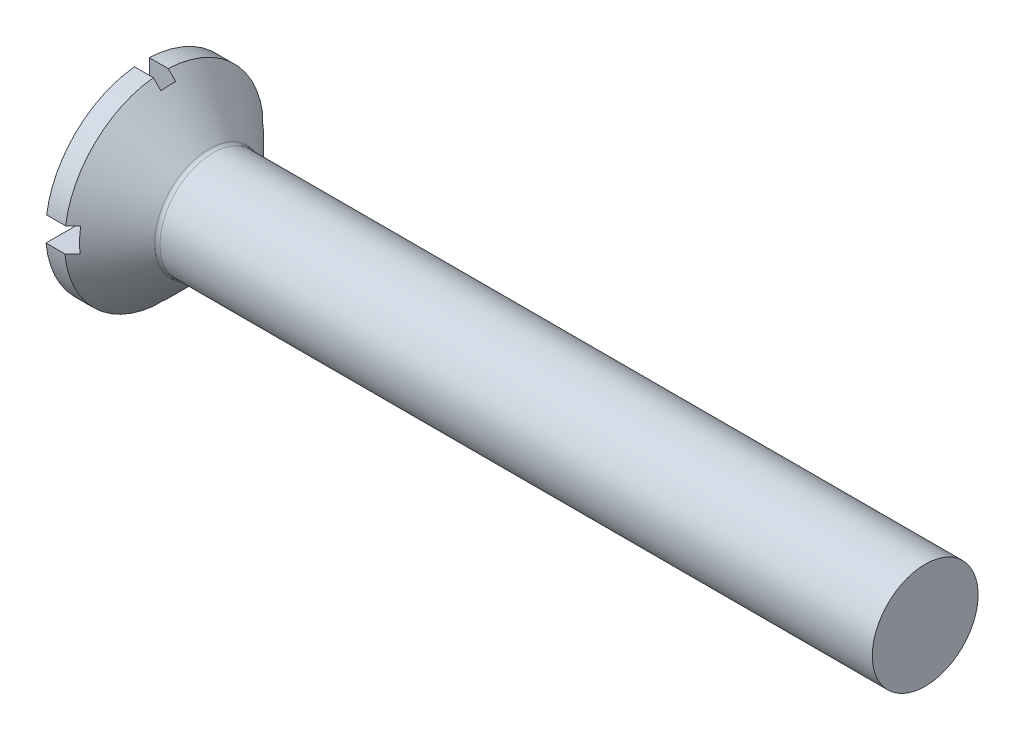
ISO-10303-21;
HEADER;
FILE_DESCRIPTION(('STEP AP214'),'2;1');
FILE_NAME('part.step','',(''),(''),'','','');
FILE_SCHEMA(('AUTOMOTIVE_DESIGN { 1 0 10303 214 1 1 1 1 }'));
ENDSEC;
DATA;
#1=APPLICATION_CONTEXT('core data for automotive mechanical design processes');
#2=APPLICATION_PROTOCOL_DEFINITION('international standard','automotive_design',2000,#1);
#3=PRODUCT_CONTEXT('',#1,'mechanical');
#4=PRODUCT('Part','Part','',(#3));
#5=PRODUCT_RELATED_PRODUCT_CATEGORY('part','',(#4));
#6=PRODUCT_DEFINITION_FORMATION('','',#4);
#7=PRODUCT_DEFINITION_CONTEXT('part definition',#1,'design');
#8=PRODUCT_DEFINITION('design','',#6,#7);
#9=PRODUCT_DEFINITION_SHAPE('','',#8);
#10=(LENGTH_UNIT() NAMED_UNIT(*) SI_UNIT(.MILLI.,.METRE.));
#11=(NAMED_UNIT(*) PLANE_ANGLE_UNIT() SI_UNIT($,.RADIAN.));
#12=(NAMED_UNIT(*) SI_UNIT($,.STERADIAN.) SOLID_ANGLE_UNIT());
#13=UNCERTAINTY_MEASURE_WITH_UNIT(LENGTH_MEASURE(1.E-05),#10,'distance_accuracy_value','');
#14=(GEOMETRIC_REPRESENTATION_CONTEXT(3) GLOBAL_UNCERTAINTY_ASSIGNED_CONTEXT((#13)) GLOBAL_UNIT_ASSIGNED_CONTEXT((#10,
#11,#12)) REPRESENTATION_CONTEXT('',''));
#15=CARTESIAN_POINT('',(0.,0.,0.));
#16=DIRECTION('',(0.,0.,1.));
#17=DIRECTION('',(1.,0.,0.));
#18=AXIS2_PLACEMENT_3D('',#15,#16,#17);
#19=CARTESIAN_POINT('',(1.,0.,0.));
#20=DIRECTION('',(-1.,0.,0.));
#21=DIRECTION('',(0.,0.,1.));
#22=AXIS2_PLACEMENT_3D('',#19,#20,#21);
#23=PLANE('',#22);
#24=DIRECTION('',(0.,1.,0.));
#25=VECTOR('',#24,1.);
#26=CARTESIAN_POINT('',(1.,-0.355709243839864,-0.156923110621762));
#27=LINE('',#26,#25);
#28=CARTESIAN_POINT('',(1.,-0.355709243839864,-0.156923110621762));
#29=VERTEX_POINT('',#28);
#30=CARTESIAN_POINT('',(1.0000000000166,-3.47646014463617,-0.156923110621762));
#31=VERTEX_POINT('',#30);
#32=EDGE_CURVE('E330',#29,#31,#27,.F.);
#33=ORIENTED_EDGE('',*,*,#32,.T.);
#34=CARTESIAN_POINT('',(1.0000000000332,0.,0.));
#35=DIRECTION('',(-1.,0.,0.));
#36=DIRECTION('',(0.,0.,1.));
#37=AXIS2_PLACEMENT_3D('',#34,#35,#36);
#38=CIRCLE('',#37,3.47999999996773);
#39=CARTESIAN_POINT('',(1.00000000002008,-3.456568160324,0.403158223159427));
#40=VERTEX_POINT('',#39);
#41=EDGE_CURVE('E230',#31,#40,#38,.T.);
#42=ORIENTED_EDGE('',*,*,#41,.T.);
#43=DIRECTION('',(0.,-1.,0.));
#44=VECTOR('',#43,1.);
#45=CARTESIAN_POINT('',(1.,-4.05674824255773,0.403158223159427));
#46=LINE('',#45,#44);
#47=CARTESIAN_POINT('',(1.,-0.355709243839864,0.403158223159425));
#48=VERTEX_POINT('',#47);
#49=EDGE_CURVE('E139',#40,#48,#46,.F.);
#50=ORIENTED_EDGE('',*,*,#49,.T.);
#51=DIRECTION('',(0.,0.,-1.));
#52=VECTOR('',#51,1.);
#53=CARTESIAN_POINT('',(1.,-0.355709243839864,0.403158223159425));
#54=LINE('',#53,#52);
#55=CARTESIAN_POINT('',(1.0000000000166,-0.355709243839867,3.46177280215467));
#56=VERTEX_POINT('',#55);
#57=EDGE_CURVE('E155',#48,#56,#54,.F.);
#58=ORIENTED_EDGE('',*,*,#57,.T.);
#59=CARTESIAN_POINT('',(1.0000000000332,0.,0.));
#60=DIRECTION('',(-1.,0.,0.));
#61=DIRECTION('',(0.,0.,1.));
#62=AXIS2_PLACEMENT_3D('',#59,#60,#61);
#63=CIRCLE('',#62,3.47999999996773);
#64=CARTESIAN_POINT('',(1.00000000002006,0.550618510763713,3.43616345005169));
#65=VERTEX_POINT('',#64);
#66=EDGE_CURVE('E20',#56,#65,#63,.T.);
#67=ORIENTED_EDGE('',*,*,#66,.T.);
#68=DIRECTION('',(0.,0.,1.));
#69=VECTOR('',#68,1.);
#70=CARTESIAN_POINT('',(1.,0.550618510763713,4.40763775047384));
#71=LINE('',#70,#69);
#72=CARTESIAN_POINT('',(1.,0.550618510763712,0.403158223159425));
#73=VERTEX_POINT('',#72);
#74=EDGE_CURVE('E119',#65,#73,#71,.F.);
#75=ORIENTED_EDGE('',*,*,#74,.T.);
#76=DIRECTION('',(0.,-1.,0.));
#77=VECTOR('',#76,1.);
#78=CARTESIAN_POINT('',(1.,0.550618510763713,0.403158223159425));
#79=LINE('',#78,#77);
#80=CARTESIAN_POINT('',(1.0000000000166,3.4565681603275,0.403158223159424));
#81=VERTEX_POINT('',#80);
#82=EDGE_CURVE('E339',#73,#81,#79,.F.);
#83=ORIENTED_EDGE('',*,*,#82,.T.);
#84=CARTESIAN_POINT('',(1.0000000000332,0.,0.));
#85=DIRECTION('',(-1.,0.,0.));
#86=DIRECTION('',(0.,0.,1.));
#87=AXIS2_PLACEMENT_3D('',#84,#85,#86);
#88=CIRCLE('',#87,3.47999999996773);
#89=CARTESIAN_POINT('',(1.0000000000201,3.47646014463266,-0.156923110621762));
#90=VERTEX_POINT('',#89);
#91=EDGE_CURVE('E154',#81,#90,#88,.T.);
#92=ORIENTED_EDGE('',*,*,#91,.T.);
#93=DIRECTION('',(0.,1.,0.));
#94=VECTOR('',#93,1.);
#95=CARTESIAN_POINT('',(1.,4.34325175744227,-0.156923110621762));
#96=LINE('',#95,#94);
#97=CARTESIAN_POINT('',(1.,0.550618510763712,-0.156923110621762));
#98=VERTEX_POINT('',#97);
#99=EDGE_CURVE('E341',#90,#98,#96,.F.);
#100=ORIENTED_EDGE('',*,*,#99,.T.);
#101=DIRECTION('',(0.,0.,1.));
#102=VECTOR('',#101,1.);
#103=CARTESIAN_POINT('',(1.,0.550618510763713,-0.156923110621761));
#104=LINE('',#103,#102);
#105=CARTESIAN_POINT('',(1.0000000000166,0.550618510763713,-3.4361634500552));
#106=VERTEX_POINT('',#105);
#107=EDGE_CURVE('E229',#98,#106,#104,.F.);
#108=ORIENTED_EDGE('',*,*,#107,.T.);
#109=CARTESIAN_POINT('',(1.0000000000332,0.,0.));
#110=DIRECTION('',(-1.,0.,0.));
#111=DIRECTION('',(0.,0.,1.));
#112=AXIS2_PLACEMENT_3D('',#109,#110,#111);
#113=CIRCLE('',#112,3.47999999996773);
#114=CARTESIAN_POINT('',(1.00000000002009,-0.355709243839861,-3.46177280215116));
#115=VERTEX_POINT('',#114);
#116=EDGE_CURVE('E402',#106,#115,#113,.T.);
#117=ORIENTED_EDGE('',*,*,#116,.T.);
#118=DIRECTION('',(0.,0.,-1.));
#119=VECTOR('',#118,1.);
#120=CARTESIAN_POINT('',(1.,-0.355709243839861,-4.09236224952616));
#121=LINE('',#120,#119);
#122=EDGE_CURVE('E148',#115,#29,#121,.F.);
#123=ORIENTED_EDGE('',*,*,#122,.T.);
#124=EDGE_LOOP('',(#33,#42,#50,#58,#67,#75,#83,#92,#100,#108,#117,#123));
#125=FACE_BOUND('',#124,.T.);
#126=ADVANCED_FACE('F17',(#125),#23,.T.);
#127=CARTESIAN_POINT('',(1.,0.550618510763713,-0.156923110621761));
#128=DIRECTION('',(0.,1.,0.));
#129=DIRECTION('',(0.,0.,1.));
#130=AXIS2_PLACEMENT_3D('',#127,#128,#129);
#131=PLANE('',#130);
#132=CARTESIAN_POINT('',(1.00000000000693,0.550618510763713,-3.43616345006499));
#133=CARTESIAN_POINT('',(0.952522390497496,0.550618510763713,-3.48424489385891));
#134=CARTESIAN_POINT('',(0.905033585692067,0.550618510763713,-3.53231527264755));
#135=CARTESIAN_POINT('',(0.810033585692013,0.550618510763713,-3.62843390000909));
#136=CARTESIAN_POINT('',(0.762522390497485,0.550618510763712,-3.67648214858208));
#137=CARTESIAN_POINT('',(0.715000000007059,0.550618510763712,-3.72451933214988));
#138=B_SPLINE_CURVE_WITH_KNOTS('',3,(#132,#133,#134,#135,#136,#137),.UNSPECIFIED.,.F.,.F.,(4,2,
4),(0.,0.202715394305867,0.405430787746274),.UNSPECIFIED.);
#139=CARTESIAN_POINT('',(0.715000000010424,0.550618510763712,-3.72451933215298));
#140=VERTEX_POINT('',#139);
#141=EDGE_CURVE('E223',#106,#140,#138,.T.);
#142=ORIENTED_EDGE('',*,*,#141,.F.);
#143=ORIENTED_EDGE('',*,*,#107,.F.);
#144=DIRECTION('',(-1.,0.,0.));
#145=VECTOR('',#144,1.);
#146=CARTESIAN_POINT('',(1.,0.550618510763712,-0.156923110621762));
#147=LINE('',#146,#145);
#148=CARTESIAN_POINT('',(0.,0.550618510763712,-0.156923110621762));
#149=VERTEX_POINT('',#148);
#150=EDGE_CURVE('E130',#98,#149,#147,.T.);
#151=ORIENTED_EDGE('',*,*,#150,.T.);
#152=DIRECTION('',(0.,0.,-1.));
#153=VECTOR('',#152,1.);
#154=CARTESIAN_POINT('',(0.,0.550618510763712,0.));
#155=LINE('',#154,#153);
#156=CARTESIAN_POINT('',(0.,0.550618510763712,-3.72451933215608));
#157=VERTEX_POINT('',#156);
#158=EDGE_CURVE('E309',#149,#157,#155,.T.);
#159=ORIENTED_EDGE('',*,*,#158,.T.);
#160=DIRECTION('',(1.,0.,0.));
#161=VECTOR('',#160,1.);
#162=CARTESIAN_POINT('',(1.,0.550618510763712,-3.72451933215607));
#163=LINE('',#162,#161);
#164=EDGE_CURVE('E228',#140,#157,#163,.F.);
#165=ORIENTED_EDGE('',*,*,#164,.F.);
#166=EDGE_LOOP('',(#142,#143,#151,#159,#165));
#167=FACE_BOUND('',#166,.T.);
#168=ADVANCED_FACE('F232',(#167),#131,.F.);
#169=CARTESIAN_POINT('',(1.,4.34325175744227,-0.156923110621762));
#170=DIRECTION('',(0.,0.,-1.));
#171=DIRECTION('',(-1.,0.,0.));
#172=AXIS2_PLACEMENT_3D('',#169,#170,#171);
#173=PLANE('',#172);
#174=DIRECTION('',(0.,1.,0.));
#175=VECTOR('',#174,1.);
#176=CARTESIAN_POINT('',(0.,0.,-0.156923110621762));
#177=LINE('',#176,#175);
#178=CARTESIAN_POINT('',(0.,3.7617283444386,-0.156923110621762));
#179=VERTEX_POINT('',#178);
#180=EDGE_CURVE('E305',#179,#149,#177,.F.);
#181=ORIENTED_EDGE('',*,*,#180,.T.);
#182=ORIENTED_EDGE('',*,*,#150,.F.);
#183=ORIENTED_EDGE('',*,*,#99,.F.);
#184=CARTESIAN_POINT('',(0.715000000003793,3.76172834443573,-0.156923110621762));
#185=CARTESIAN_POINT('',(0.762501760869479,3.71418540368166,-0.156923110621762));
#186=CARTESIAN_POINT('',(0.81000264130227,3.66664158332245,-0.156923110621762));
#187=CARTESIAN_POINT('',(0.905002641303341,3.57155218339247,-0.156923110621762));
#188=CARTESIAN_POINT('',(0.952501760871621,3.52400660382169,-0.156923110621762));
#189=CARTESIAN_POINT('',(1.00000000000701,3.47646014464577,-0.156923110621762));
#190=B_SPLINE_CURVE_WITH_KNOTS('',3,(#184,#185,#186,#187,#188,#189),.UNSPECIFIED.,.F.,.F.,(4,2,
4),(0.,0.201620277914085,0.403240555833609),.UNSPECIFIED.);
#191=CARTESIAN_POINT('',(0.715000000007359,3.76172834443217,-0.156923110621762));
#192=VERTEX_POINT('',#191);
#193=EDGE_CURVE('E216',#192,#90,#190,.T.);
#194=ORIENTED_EDGE('',*,*,#193,.F.);
#195=DIRECTION('',(-1.,0.,0.));
#196=VECTOR('',#195,1.);
#197=CARTESIAN_POINT('',(1.,3.7617283444386,-0.156923110621762));
#198=LINE('',#197,#196);
#199=EDGE_CURVE('E337',#179,#192,#198,.F.);
#200=ORIENTED_EDGE('',*,*,#199,.F.);
#201=EDGE_LOOP('',(#181,#182,#183,#194,#200));
#202=FACE_BOUND('',#201,.T.);
#203=ADVANCED_FACE('F235',(#202),#173,.F.);
#204=CARTESIAN_POINT('',(1.,0.550618510763713,0.403158223159425));
#205=DIRECTION('',(0.,0.,1.));
#206=DIRECTION('',(0.,-1.,0.));
#207=AXIS2_PLACEMENT_3D('',#204,#205,#206);
#208=PLANE('',#207);
#209=CARTESIAN_POINT('',(1.00000000000697,3.4565681603372,0.403158223159424));
#210=CARTESIAN_POINT('',(0.952511808864706,3.50437729702399,0.403158223159424));
#211=CARTESIAN_POINT('',(0.905017713279324,3.55218056600584,0.403158223159424));
#212=CARTESIAN_POINT('',(0.810017713279351,3.64777536850222,0.403158223159424));
#213=CARTESIAN_POINT('',(0.762511808864773,3.69556690201678,0.403158223159424));
#214=CARTESIAN_POINT('',(0.715000000007091,3.7433525678264,0.403158223159424));
#215=B_SPLINE_CURVE_WITH_KNOTS('',3,(#209,#210,#211,#212,#213,#214),.UNSPECIFIED.,.F.,.F.,(4,2,
4),(0.,0.202157302038321,0.404314603833935),.UNSPECIFIED.);
#216=CARTESIAN_POINT('',(0.715000000010439,3.7433525678295,0.403158223159424));
#217=VERTEX_POINT('',#216);
#218=EDGE_CURVE('E209',#81,#217,#215,.T.);
#219=ORIENTED_EDGE('',*,*,#218,.F.);
#220=ORIENTED_EDGE('',*,*,#82,.F.);
#221=DIRECTION('',(1.,0.,0.));
#222=VECTOR('',#221,1.);
#223=CARTESIAN_POINT('',(1.,0.550618510763712,0.403158223159425));
#224=LINE('',#223,#222);
#225=CARTESIAN_POINT('',(0.,0.550618510763713,0.403158223159425));
#226=VERTEX_POINT('',#225);
#227=EDGE_CURVE('E331',#73,#226,#224,.F.);
#228=ORIENTED_EDGE('',*,*,#227,.T.);
#229=DIRECTION('',(0.,1.,0.));
#230=VECTOR('',#229,1.);
#231=CARTESIAN_POINT('',(0.,0.,0.403158223159425));
#232=LINE('',#231,#230);
#233=CARTESIAN_POINT('',(0.,3.7433525678326,0.403158223159424));
#234=VERTEX_POINT('',#233);
#235=EDGE_CURVE('E300',#226,#234,#232,.T.);
#236=ORIENTED_EDGE('',*,*,#235,.T.);
#237=DIRECTION('',(1.,0.,0.));
#238=VECTOR('',#237,1.);
#239=CARTESIAN_POINT('',(1.,3.7433525678326,0.403158223159424));
#240=LINE('',#239,#238);
#241=EDGE_CURVE('E335',#217,#234,#240,.F.);
#242=ORIENTED_EDGE('',*,*,#241,.F.);
#243=EDGE_LOOP('',(#219,#220,#228,#236,#242));
#244=FACE_BOUND('',#243,.T.);
#245=ADVANCED_FACE('F238',(#244),#208,.F.);
#246=CARTESIAN_POINT('',(1.,0.550618510763713,4.40763775047384));
#247=DIRECTION('',(0.,1.,0.));
#248=DIRECTION('',(0.,0.,1.));
#249=AXIS2_PLACEMENT_3D('',#246,#247,#248);
#250=PLANE('',#249);
#251=DIRECTION('',(0.,0.,-1.));
#252=VECTOR('',#251,1.);
#253=CARTESIAN_POINT('',(0.,0.550618510763713,0.));
#254=LINE('',#253,#252);
#255=CARTESIAN_POINT('',(0.,0.550618510763713,3.72451933215608));
#256=VERTEX_POINT('',#255);
#257=EDGE_CURVE('E295',#256,#226,#254,.T.);
#258=ORIENTED_EDGE('',*,*,#257,.T.);
#259=ORIENTED_EDGE('',*,*,#227,.F.);
#260=ORIENTED_EDGE('',*,*,#74,.F.);
#261=CARTESIAN_POINT('',(0.715000000003765,0.550618510763713,3.72451933215321));
#262=CARTESIAN_POINT('',(0.76252239049474,0.550618510763713,3.67648214858485));
#263=CARTESIAN_POINT('',(0.810033585689818,0.550618510763713,3.62843390001131));
#264=CARTESIAN_POINT('',(0.90503358569097,0.550618510763713,3.53231527264866));
#265=CARTESIAN_POINT('',(0.952522390496948,0.550618510763713,3.48424489385947));
#266=CARTESIAN_POINT('',(1.00000000000693,0.550618510763713,3.43616345006499));
#267=B_SPLINE_CURVE_WITH_KNOTS('',3,(#261,#262,#263,#264,#265,#266),.UNSPECIFIED.,.F.,.F.,(4,2,
4),(0.,0.202715393442749,0.405430787750959),.UNSPECIFIED.);
#268=CARTESIAN_POINT('',(0.715000000007359,0.550618510763713,3.72451933214958));
#269=VERTEX_POINT('',#268);
#270=EDGE_CURVE('E112',#269,#65,#267,.T.);
#271=ORIENTED_EDGE('',*,*,#270,.F.);
#272=DIRECTION('',(1.,0.,0.));
#273=VECTOR('',#272,1.);
#274=CARTESIAN_POINT('',(1.,0.550618510763713,3.72451933215607));
#275=LINE('',#274,#273);
#276=EDGE_CURVE('E328',#256,#269,#275,.T.);
#277=ORIENTED_EDGE('',*,*,#276,.F.);
#278=EDGE_LOOP('',(#258,#259,#260,#271,#277));
#279=FACE_BOUND('',#278,.T.);
#280=ADVANCED_FACE('F242',(#279),#250,.F.);
#281=CARTESIAN_POINT('',(1.,-0.355709243839864,-0.156923110621762));
#282=DIRECTION('',(0.,0.,-1.));
#283=DIRECTION('',(-1.,0.,0.));
#284=AXIS2_PLACEMENT_3D('',#281,#282,#283);
#285=PLANE('',#284);
#286=CARTESIAN_POINT('',(1.00000000000701,-3.47646014464577,-0.156923110621762));
#287=CARTESIAN_POINT('',(0.952501760872176,-3.52400660382113,-0.156923110621762));
#288=CARTESIAN_POINT('',(0.90500264130445,-3.57155218339136,-0.156923110621762));
#289=CARTESIAN_POINT('',(0.810002641304488,-3.66664158332023,-0.156923110621762));
#290=CARTESIAN_POINT('',(0.762501760872253,-3.71418540367889,-0.156923110621762));
#291=CARTESIAN_POINT('',(0.715000000007121,-3.7617283444324,-0.156923110621762));
#292=B_SPLINE_CURVE_WITH_KNOTS('',3,(#286,#287,#288,#289,#290,#291),.UNSPECIFIED.,.F.,.F.,(4,2,
4),(0.,0.20162027791717,0.4032405558289),.UNSPECIFIED.);
#293=CARTESIAN_POINT('',(0.715000000010455,-3.7617283444355,-0.156923110621762));
#294=VERTEX_POINT('',#293);
#295=EDGE_CURVE('E195',#31,#294,#292,.T.);
#296=ORIENTED_EDGE('',*,*,#295,.F.);
#297=ORIENTED_EDGE('',*,*,#32,.F.);
#298=DIRECTION('',(1.,0.,0.));
#299=VECTOR('',#298,1.);
#300=CARTESIAN_POINT('',(1.,-0.355709243839864,-0.156923110621762));
#301=LINE('',#300,#299);
#302=CARTESIAN_POINT('',(0.,-0.355709243839862,-0.156923110621762));
#303=VERTEX_POINT('',#302);
#304=EDGE_CURVE('E322',#29,#303,#301,.F.);
#305=ORIENTED_EDGE('',*,*,#304,.T.);
#306=DIRECTION('',(0.,1.,0.));
#307=VECTOR('',#306,1.);
#308=CARTESIAN_POINT('',(0.,0.,-0.156923110621762));
#309=LINE('',#308,#307);
#310=CARTESIAN_POINT('',(0.,-3.7617283444386,-0.156923110621762));
#311=VERTEX_POINT('',#310);
#312=EDGE_CURVE('E290',#303,#311,#309,.F.);
#313=ORIENTED_EDGE('',*,*,#312,.T.);
#314=DIRECTION('',(-1.,0.,0.));
#315=VECTOR('',#314,1.);
#316=CARTESIAN_POINT('',(1.,-3.7617283444386,-0.156923110621762));
#317=LINE('',#316,#315);
#318=EDGE_CURVE('E326',#294,#311,#317,.T.);
#319=ORIENTED_EDGE('',*,*,#318,.F.);
#320=EDGE_LOOP('',(#296,#297,#305,#313,#319));
#321=FACE_BOUND('',#320,.T.);
#322=ADVANCED_FACE('F246',(#321),#285,.F.);
#323=CARTESIAN_POINT('',(1.,-0.355709243839861,-4.09236224952616));
#324=DIRECTION('',(0.,-1.,0.));
#325=DIRECTION('',(0.,0.,-1.));
#326=AXIS2_PLACEMENT_3D('',#323,#324,#325);
#327=PLANE('',#326);
#328=DIRECTION('',(0.,0.,-1.));
#329=VECTOR('',#328,1.);
#330=CARTESIAN_POINT('',(0.,-0.355709243839861,0.));
#331=LINE('',#330,#329);
#332=CARTESIAN_POINT('',(0.,-0.355709243839861,-3.74815900594504));
#333=VERTEX_POINT('',#332);
#334=EDGE_CURVE('E286',#333,#303,#331,.F.);
#335=ORIENTED_EDGE('',*,*,#334,.T.);
#336=ORIENTED_EDGE('',*,*,#304,.F.);
#337=ORIENTED_EDGE('',*,*,#122,.F.);
#338=CARTESIAN_POINT('',(0.715000000003782,-0.355709243839861,-3.74815900594217));
#339=CARTESIAN_POINT('',(0.762509154586003,-0.355709243839861,-3.70043708228406));
#340=CARTESIAN_POINT('',(0.810013731868789,-0.355709243839861,-3.65271060348215));
#341=CARTESIAN_POINT('',(0.905013731869861,-0.355709243839861,-3.55724853555621));
#342=CARTESIAN_POINT('',(0.95250915458814,-0.355709243839861,-3.50951294643218));
#343=CARTESIAN_POINT('',(1.00000000000698,-0.355709243839861,-3.46177280216434));
#344=B_SPLINE_CURVE_WITH_KNOTS('',3,(#338,#339,#340,#341,#342,#343),.UNSPECIFIED.,.F.,.F.,(4,2,
4),(0.,0.202016125036606,0.404032250219377),.UNSPECIFIED.);
#345=CARTESIAN_POINT('',(0.715000000007358,-0.355709243839861,-3.74815900593858));
#346=VERTEX_POINT('',#345);
#347=EDGE_CURVE('E177',#346,#115,#344,.T.);
#348=ORIENTED_EDGE('',*,*,#347,.F.);
#349=DIRECTION('',(1.,0.,0.));
#350=VECTOR('',#349,1.);
#351=CARTESIAN_POINT('',(1.,-0.355709243839861,-3.74815900594503));
#352=LINE('',#351,#350);
#353=EDGE_CURVE('E159',#333,#346,#352,.T.);
#354=ORIENTED_EDGE('',*,*,#353,.F.);
#355=EDGE_LOOP('',(#335,#336,#337,#348,#354));
#356=FACE_BOUND('',#355,.T.);
#357=ADVANCED_FACE('F250',(#356),#327,.F.);
#358=CARTESIAN_POINT('',(1.,-0.355709243839864,0.403158223159425));
#359=DIRECTION('',(0.,-1.,0.));
#360=DIRECTION('',(0.,0.,-1.));
#361=AXIS2_PLACEMENT_3D('',#358,#359,#360);
#362=PLANE('',#361);
#363=CARTESIAN_POINT('',(1.00000000000698,-0.355709243839867,3.46177280216434));
#364=CARTESIAN_POINT('',(0.952509154588694,-0.355709243839867,3.50951294643162));
#365=CARTESIAN_POINT('',(0.905013731870968,-0.355709243839867,3.5572485355551));
#366=CARTESIAN_POINT('',(0.810013731871,-0.355709243839867,3.65271060347993));
#367=CARTESIAN_POINT('',(0.762509154588766,-0.355709243839867,3.70043708228128));
#368=CARTESIAN_POINT('',(0.715000000007098,-0.355709243839868,3.74815900593884));
#369=B_SPLINE_CURVE_WITH_KNOTS('',3,(#363,#364,#365,#366,#367,#368),.UNSPECIFIED.,.F.,.F.,(4,2,
4),(0.,0.202016125180422,0.404032250214679),.UNSPECIFIED.);
#370=CARTESIAN_POINT('',(0.715000000010443,-0.355709243839868,3.74815900594194));
#371=VERTEX_POINT('',#370);
#372=EDGE_CURVE('E153',#56,#371,#369,.T.);
#373=ORIENTED_EDGE('',*,*,#372,.F.);
#374=ORIENTED_EDGE('',*,*,#57,.F.);
#375=DIRECTION('',(1.,0.,0.));
#376=VECTOR('',#375,1.);
#377=CARTESIAN_POINT('',(1.,-0.355709243839864,0.403158223159425));
#378=LINE('',#377,#376);
#379=CARTESIAN_POINT('',(0.,-0.355709243839864,0.403158223159426));
#380=VERTEX_POINT('',#379);
#381=EDGE_CURVE('E317',#48,#380,#378,.F.);
#382=ORIENTED_EDGE('',*,*,#381,.T.);
#383=DIRECTION('',(0.,0.,-1.));
#384=VECTOR('',#383,1.);
#385=CARTESIAN_POINT('',(0.,-0.355709243839864,0.));
#386=LINE('',#385,#384);
#387=CARTESIAN_POINT('',(0.,-0.355709243839866,3.74815900594503));
#388=VERTEX_POINT('',#387);
#389=EDGE_CURVE('E282',#380,#388,#386,.F.);
#390=ORIENTED_EDGE('',*,*,#389,.T.);
#391=DIRECTION('',(1.,0.,0.));
#392=VECTOR('',#391,1.);
#393=CARTESIAN_POINT('',(1.,-0.355709243839868,3.74815900594503));
#394=LINE('',#393,#392);
#395=EDGE_CURVE('E35',#371,#388,#394,.F.);
#396=ORIENTED_EDGE('',*,*,#395,.F.);
#397=EDGE_LOOP('',(#373,#374,#382,#390,#396));
#398=FACE_BOUND('',#397,.T.);
#399=ADVANCED_FACE('F161',(#398),#362,.F.);
#400=CARTESIAN_POINT('',(1.,-4.05674824255773,0.403158223159427));
#401=DIRECTION('',(0.,0.,1.));
#402=DIRECTION('',(0.,-1.,0.));
#403=AXIS2_PLACEMENT_3D('',#400,#401,#402);
#404=PLANE('',#403);
#405=DIRECTION('',(0.,1.,0.));
#406=VECTOR('',#405,1.);
#407=CARTESIAN_POINT('',(0.,0.,0.403158223159427));
#408=LINE('',#407,#406);
#409=CARTESIAN_POINT('',(0.,-3.7433525678326,0.403158223159427));
#410=VERTEX_POINT('',#409);
#411=EDGE_CURVE('E278',#410,#380,#408,.T.);
#412=ORIENTED_EDGE('',*,*,#411,.T.);
#413=ORIENTED_EDGE('',*,*,#381,.F.);
#414=ORIENTED_EDGE('',*,*,#49,.F.);
#415=CARTESIAN_POINT('',(0.715000000003779,-3.74335256782973,0.403158223159427));
#416=CARTESIAN_POINT('',(0.762511808862014,-3.69556690201956,0.403158223159427));
#417=CARTESIAN_POINT('',(0.810017713277144,-3.64777536850444,0.403158223159427));
#418=CARTESIAN_POINT('',(0.905017713278221,-3.55218056600695,0.403158223159427));
#419=CARTESIAN_POINT('',(0.952511808864155,-3.50437729702455,0.403158223159427));
#420=CARTESIAN_POINT('',(1.00000000000697,-3.4565681603372,0.403158223159427));
#421=B_SPLINE_CURVE_WITH_KNOTS('',3,(#415,#416,#417,#418,#419,#420),.UNSPECIFIED.,.F.,.F.,(4,2,
4),(0.,0.202157301797964,0.404314603838633),.UNSPECIFIED.);
#422=CARTESIAN_POINT('',(0.715000000007358,-3.74335256782613,0.403158223159427));
#423=VERTEX_POINT('',#422);
#424=EDGE_CURVE('E163',#423,#40,#421,.T.);
#425=ORIENTED_EDGE('',*,*,#424,.F.);
#426=DIRECTION('',(1.,0.,0.));
#427=VECTOR('',#426,1.);
#428=CARTESIAN_POINT('',(1.,-3.7433525678326,0.403158223159427));
#429=LINE('',#428,#427);
#430=EDGE_CURVE('E313',#410,#423,#429,.T.);
#431=ORIENTED_EDGE('',*,*,#430,.F.);
#432=EDGE_LOOP('',(#412,#413,#414,#425,#431));
#433=FACE_BOUND('',#432,.T.);
#434=ADVANCED_FACE('F259',(#433),#404,.F.);
#435=CARTESIAN_POINT('',(0.,0.,0.));
#436=DIRECTION('',(1.,0.,0.));
#437=DIRECTION('',(0.,0.,-1.));
#438=AXIS2_PLACEMENT_3D('',#435,#436,#437);
#439=PLANE('',#438);
#440=CARTESIAN_POINT('',(0.,0.,0.));
#441=DIRECTION('',(1.,0.,0.));
#442=DIRECTION('',(0.,0.,-1.));
#443=AXIS2_PLACEMENT_3D('',#440,#441,#442);
#444=CIRCLE('',#443,3.765);
#445=EDGE_CURVE('E281',#157,#179,#444,.T.);
#446=ORIENTED_EDGE('',*,*,#445,.F.);
#447=ORIENTED_EDGE('',*,*,#158,.F.);
#448=ORIENTED_EDGE('',*,*,#180,.F.);
#449=EDGE_LOOP('',(#446,#447,#448));
#450=FACE_BOUND('',#449,.T.);
#451=ADVANCED_FACE('F397',(#450),#439,.F.);
#452=CARTESIAN_POINT('',(0.,0.,0.));
#453=DIRECTION('',(1.,0.,0.));
#454=DIRECTION('',(0.,0.,-1.));
#455=AXIS2_PLACEMENT_3D('',#452,#453,#454);
#456=PLANE('',#455);
#457=CARTESIAN_POINT('',(0.,0.,0.));
#458=DIRECTION('',(1.,0.,0.));
#459=DIRECTION('',(0.,0.,-1.));
#460=AXIS2_PLACEMENT_3D('',#457,#458,#459);
#461=CIRCLE('',#460,3.765);
#462=EDGE_CURVE('E386',#234,#256,#461,.T.);
#463=ORIENTED_EDGE('',*,*,#462,.F.);
#464=ORIENTED_EDGE('',*,*,#235,.F.);
#465=ORIENTED_EDGE('',*,*,#257,.F.);
#466=EDGE_LOOP('',(#463,#464,#465));
#467=FACE_BOUND('',#466,.T.);
#468=ADVANCED_FACE('F431',(#467),#456,.F.);
#469=CARTESIAN_POINT('',(0.,0.,0.));
#470=DIRECTION('',(1.,0.,0.));
#471=DIRECTION('',(0.,0.,-1.));
#472=AXIS2_PLACEMENT_3D('',#469,#470,#471);
#473=PLANE('',#472);
#474=CARTESIAN_POINT('',(0.,0.,0.));
#475=DIRECTION('',(1.,0.,0.));
#476=DIRECTION('',(0.,0.,-1.));
#477=AXIS2_PLACEMENT_3D('',#474,#475,#476);
#478=CIRCLE('',#477,3.765);
#479=EDGE_CURVE('E383',#311,#333,#478,.T.);
#480=ORIENTED_EDGE('',*,*,#479,.F.);
#481=ORIENTED_EDGE('',*,*,#312,.F.);
#482=ORIENTED_EDGE('',*,*,#334,.F.);
#483=EDGE_LOOP('',(#480,#481,#482));
#484=FACE_BOUND('',#483,.T.);
#485=ADVANCED_FACE('F428',(#484),#473,.F.);
#486=CARTESIAN_POINT('',(0.,0.,0.));
#487=DIRECTION('',(1.,0.,0.));
#488=DIRECTION('',(0.,0.,-1.));
#489=AXIS2_PLACEMENT_3D('',#486,#487,#488);
#490=PLANE('',#489);
#491=CARTESIAN_POINT('',(0.,0.,0.));
#492=DIRECTION('',(1.,0.,0.));
#493=DIRECTION('',(0.,0.,-1.));
#494=AXIS2_PLACEMENT_3D('',#491,#492,#493);
#495=CIRCLE('',#494,3.765);
#496=EDGE_CURVE('E371',#388,#410,#495,.T.);
#497=ORIENTED_EDGE('',*,*,#496,.F.);
#498=ORIENTED_EDGE('',*,*,#389,.F.);
#499=ORIENTED_EDGE('',*,*,#411,.F.);
#500=EDGE_LOOP('',(#497,#498,#499));
#501=FACE_BOUND('',#500,.T.);
#502=ADVANCED_FACE('F410',(#501),#490,.F.);
#503=CARTESIAN_POINT('',(11.8531386861314,0.,0.));
#504=DIRECTION('',(1.,0.,0.));
#505=DIRECTION('',(0.,0.,-1.));
#506=AXIS2_PLACEMENT_3D('',#503,#504,#505);
#507=CYLINDRICAL_SURFACE('',#506,3.765);
#508=ORIENTED_EDGE('',*,*,#164,.T.);
#509=ORIENTED_EDGE('',*,*,#445,.T.);
#510=ORIENTED_EDGE('',*,*,#199,.T.);
#511=CARTESIAN_POINT('',(0.715000000013788,0.,0.));
#512=DIRECTION('',(-1.,0.,0.));
#513=DIRECTION('',(0.,0.,-1.));
#514=AXIS2_PLACEMENT_3D('',#511,#512,#513);
#515=CIRCLE('',#514,3.76499999998714);
#516=EDGE_CURVE('E362',#140,#192,#515,.F.);
#517=ORIENTED_EDGE('',*,*,#516,.F.);
#518=EDGE_LOOP('',(#508,#509,#510,#517));
#519=FACE_BOUND('',#518,.T.);
#520=ADVANCED_FACE('F391',(#519),#507,.T.);
#521=CARTESIAN_POINT('',(11.8531386861314,0.,0.));
#522=DIRECTION('',(1.,0.,0.));
#523=DIRECTION('',(0.,0.,-1.));
#524=AXIS2_PLACEMENT_3D('',#521,#522,#523);
#525=CYLINDRICAL_SURFACE('',#524,3.765);
#526=ORIENTED_EDGE('',*,*,#241,.T.);
#527=ORIENTED_EDGE('',*,*,#462,.T.);
#528=ORIENTED_EDGE('',*,*,#276,.T.);
#529=CARTESIAN_POINT('',(0.715000000013788,0.,0.));
#530=DIRECTION('',(-1.,0.,0.));
#531=DIRECTION('',(0.,0.,-1.));
#532=AXIS2_PLACEMENT_3D('',#529,#530,#531);
#533=CIRCLE('',#532,3.76499999998714);
#534=EDGE_CURVE('E354',#217,#269,#533,.F.);
#535=ORIENTED_EDGE('',*,*,#534,.F.);
#536=EDGE_LOOP('',(#526,#527,#528,#535));
#537=FACE_BOUND('',#536,.T.);
#538=ADVANCED_FACE('F416',(#537),#525,.T.);
#539=CARTESIAN_POINT('',(11.8531386861314,0.,0.));
#540=DIRECTION('',(1.,0.,0.));
#541=DIRECTION('',(0.,0.,-1.));
#542=AXIS2_PLACEMENT_3D('',#539,#540,#541);
#543=CYLINDRICAL_SURFACE('',#542,3.765);
#544=ORIENTED_EDGE('',*,*,#318,.T.);
#545=ORIENTED_EDGE('',*,*,#479,.T.);
#546=ORIENTED_EDGE('',*,*,#353,.T.);
#547=CARTESIAN_POINT('',(0.715000000013788,0.,0.));
#548=DIRECTION('',(-1.,0.,0.));
#549=DIRECTION('',(0.,0.,-1.));
#550=AXIS2_PLACEMENT_3D('',#547,#548,#549);
#551=CIRCLE('',#550,3.76499999998714);
#552=EDGE_CURVE('E345',#294,#346,#551,.F.);
#553=ORIENTED_EDGE('',*,*,#552,.F.);
#554=EDGE_LOOP('',(#544,#545,#546,#553));
#555=FACE_BOUND('',#554,.T.);
#556=ADVANCED_FACE('F412',(#555),#543,.T.);
#557=CARTESIAN_POINT('',(11.8531386861314,0.,0.));
#558=DIRECTION('',(1.,0.,0.));
#559=DIRECTION('',(0.,0.,-1.));
#560=AXIS2_PLACEMENT_3D('',#557,#558,#559);
#561=CYLINDRICAL_SURFACE('',#560,3.765);
#562=ORIENTED_EDGE('',*,*,#395,.T.);
#563=ORIENTED_EDGE('',*,*,#496,.T.);
#564=ORIENTED_EDGE('',*,*,#430,.T.);
#565=CARTESIAN_POINT('',(0.715000000013788,0.,0.));
#566=DIRECTION('',(-1.,0.,0.));
#567=DIRECTION('',(0.,0.,-1.));
#568=AXIS2_PLACEMENT_3D('',#565,#566,#567);
#569=CIRCLE('',#568,3.76499999998714);
#570=EDGE_CURVE('E277',#371,#423,#569,.F.);
#571=ORIENTED_EDGE('',*,*,#570,.F.);
#572=EDGE_LOOP('',(#562,#563,#564,#571));
#573=FACE_BOUND('',#572,.T.);
#574=ADVANCED_FACE('F189',(#573),#561,.T.);
#575=CARTESIAN_POINT('',(0.715000000070631,0.,0.));
#576=DIRECTION('',(-1.,0.,0.));
#577=DIRECTION('',(0.,0.,1.));
#578=AXIS2_PLACEMENT_3D('',#575,#576,#577);
#579=CONICAL_SURFACE('',#578,3.7649999999303,0.785398163397448);
#580=CARTESIAN_POINT('',(2.42142135623731,0.,0.));
#581=DIRECTION('',(-1.,0.,0.));
#582=DIRECTION('',(0.,0.,-1.));
#583=AXIS2_PLACEMENT_3D('',#580,#581,#582);
#584=CIRCLE('',#583,2.05857864376269);
#585=CARTESIAN_POINT('',(2.42142135623731,0.,-2.05857864376269));
#586=VERTEX_POINT('',#585);
#587=EDGE_CURVE('E274',#586,#586,#584,.T.);
#588=ORIENTED_EDGE('',*,*,#587,.T.);
#589=EDGE_LOOP('',(#588));
#590=FACE_BOUND('',#589,.T.);
#591=ORIENTED_EDGE('',*,*,#372,.T.);
#592=ORIENTED_EDGE('',*,*,#570,.T.);
#593=ORIENTED_EDGE('',*,*,#424,.T.);
#594=ORIENTED_EDGE('',*,*,#41,.F.);
#595=ORIENTED_EDGE('',*,*,#295,.T.);
#596=ORIENTED_EDGE('',*,*,#552,.T.);
#597=ORIENTED_EDGE('',*,*,#347,.T.);
#598=ORIENTED_EDGE('',*,*,#116,.F.);
#599=ORIENTED_EDGE('',*,*,#141,.T.);
#600=ORIENTED_EDGE('',*,*,#516,.T.);
#601=ORIENTED_EDGE('',*,*,#193,.T.);
#602=ORIENTED_EDGE('',*,*,#91,.F.);
#603=ORIENTED_EDGE('',*,*,#218,.T.);
#604=ORIENTED_EDGE('',*,*,#534,.T.);
#605=ORIENTED_EDGE('',*,*,#270,.T.);
#606=ORIENTED_EDGE('',*,*,#66,.F.);
#607=EDGE_LOOP('',(#591,#592,#593,#594,#595,#596,#597,#598,#599,#600,#601,#602,#603,#604,#605,#606));
#608=FACE_BOUND('',#607,.T.);
#609=ADVANCED_FACE('F150',(#590,#608),#579,.T.);
#610=CARTESIAN_POINT('',(29.5,0.,0.));
#611=DIRECTION('',(-1.,0.,0.));
#612=DIRECTION('',(0.,0.,1.));
#613=AXIS2_PLACEMENT_3D('',#610,#611,#612);
#614=PLANE('',#613);
#615=CARTESIAN_POINT('',(29.5,0.,0.));
#616=DIRECTION('',(-1.,0.,0.));
#617=DIRECTION('',(0.,0.,1.));
#618=AXIS2_PLACEMENT_3D('',#615,#616,#617);
#619=CIRCLE('',#618,2.);
#620=CARTESIAN_POINT('',(29.5,0.,2.));
#621=VERTEX_POINT('',#620);
#622=EDGE_CURVE('E26',#621,#621,#619,.T.);
#623=ORIENTED_EDGE('',*,*,#622,.F.);
#624=EDGE_LOOP('',(#623));
#625=FACE_BOUND('',#624,.T.);
#626=ADVANCED_FACE('F188',(#625),#614,.F.);
#627=CARTESIAN_POINT('',(2.56284271247462,0.,0.));
#628=DIRECTION('',(-1.,0.,0.));
#629=DIRECTION('',(0.,0.,-1.));
#630=AXIS2_PLACEMENT_3D('',#627,#628,#629);
#631=TOROIDAL_SURFACE('',#630,2.2,0.2);
#632=CARTESIAN_POINT('',(2.56284271247462,0.,0.));
#633=DIRECTION('',(-1.,0.,0.));
#634=DIRECTION('',(0.,0.,1.));
#635=AXIS2_PLACEMENT_3D('',#632,#633,#634);
#636=CIRCLE('',#635,2.);
#637=CARTESIAN_POINT('',(2.56284271247462,0.,2.));
#638=VERTEX_POINT('',#637);
#639=EDGE_CURVE('E10',#638,#638,#636,.F.);
#640=ORIENTED_EDGE('',*,*,#639,.F.);
#641=EDGE_LOOP('',(#640));
#642=FACE_BOUND('',#641,.T.);
#643=ORIENTED_EDGE('',*,*,#587,.F.);
#644=EDGE_LOOP('',(#643));
#645=FACE_BOUND('',#644,.T.);
#646=ADVANCED_FACE('F263',(#642,#645),#631,.F.);
#647=CARTESIAN_POINT('',(-0.587069180985524,0.,0.));
#648=DIRECTION('',(-1.,0.,0.));
#649=DIRECTION('',(0.,0.,1.));
#650=AXIS2_PLACEMENT_3D('',#647,#648,#649);
#651=CYLINDRICAL_SURFACE('',#650,2.);
#652=ORIENTED_EDGE('',*,*,#639,.T.);
#653=EDGE_LOOP('',(#652));
#654=FACE_BOUND('',#653,.T.);
#655=ORIENTED_EDGE('',*,*,#622,.T.);
#656=EDGE_LOOP('',(#655));
#657=FACE_BOUND('',#656,.T.);
#658=ADVANCED_FACE('F261',(#654,#657),#651,.T.);
#659=CLOSED_SHELL('',(#126,#168,#203,#245,#280,#322,#357,#399,#434,#451,#468,#485,#502,#520,
#538,#556,#574,#609,#626,#646,#658));
#660=MANIFOLD_SOLID_BREP('B1',#659);
#661=ADVANCED_BREP_SHAPE_REPRESENTATION('',(#18,#660),#14);
#662=SHAPE_DEFINITION_REPRESENTATION(#9,#661);
ENDSEC;
END-ISO-10303-21;
